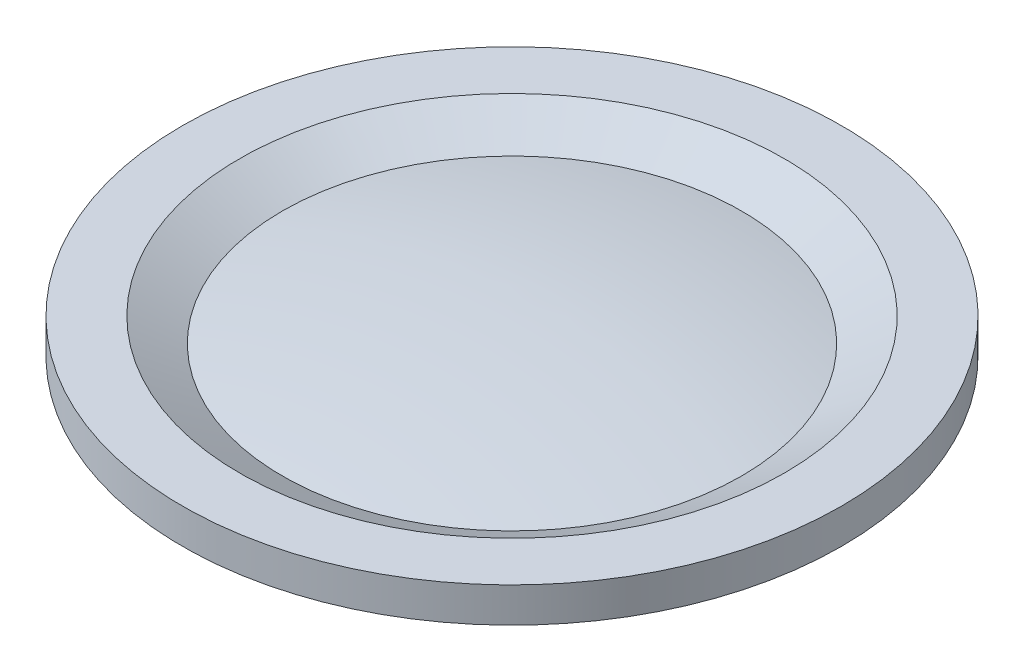
ISO-10303-21;
HEADER;
FILE_DESCRIPTION(('STEP AP214'),'2;1');
FILE_NAME('part.step','',(''),(''),'','','');
FILE_SCHEMA(('AUTOMOTIVE_DESIGN { 1 0 10303 214 1 1 1 1 }'));
ENDSEC;
DATA;
#1=APPLICATION_CONTEXT('core data for automotive mechanical design processes');
#2=APPLICATION_PROTOCOL_DEFINITION('international standard','automotive_design',2000,#1);
#3=PRODUCT_CONTEXT('',#1,'mechanical');
#4=PRODUCT('Part','Part','',(#3));
#5=PRODUCT_RELATED_PRODUCT_CATEGORY('part','',(#4));
#6=PRODUCT_DEFINITION_FORMATION('','',#4);
#7=PRODUCT_DEFINITION_CONTEXT('part definition',#1,'design');
#8=PRODUCT_DEFINITION('design','',#6,#7);
#9=PRODUCT_DEFINITION_SHAPE('','',#8);
#10=(LENGTH_UNIT() NAMED_UNIT(*) SI_UNIT(.MILLI.,.METRE.));
#11=(NAMED_UNIT(*) PLANE_ANGLE_UNIT() SI_UNIT($,.RADIAN.));
#12=(NAMED_UNIT(*) SI_UNIT($,.STERADIAN.) SOLID_ANGLE_UNIT());
#13=UNCERTAINTY_MEASURE_WITH_UNIT(LENGTH_MEASURE(1.E-05),#10,'distance_accuracy_value','');
#14=(GEOMETRIC_REPRESENTATION_CONTEXT(3) GLOBAL_UNCERTAINTY_ASSIGNED_CONTEXT((#13)) GLOBAL_UNIT_ASSIGNED_CONTEXT((#10,
#11,#12)) REPRESENTATION_CONTEXT('',''));
#15=CARTESIAN_POINT('',(0.,0.,0.));
#16=DIRECTION('',(0.,0.,1.));
#17=DIRECTION('',(1.,0.,0.));
#18=AXIS2_PLACEMENT_3D('',#15,#16,#17);
#19=CARTESIAN_POINT('',(0.,0.159999999999966,0.));
#20=DIRECTION('',(0.,1.,0.));
#21=DIRECTION('',(0.,0.,1.));
#22=AXIS2_PLACEMENT_3D('',#19,#20,#21);
#23=CYLINDRICAL_SURFACE('',#22,8.70000000000001);
#24=CARTESIAN_POINT('',(0.,1.59999999999997,0.));
#25=DIRECTION('',(0.,1.,0.));
#26=DIRECTION('',(0.,0.,-1.));
#27=AXIS2_PLACEMENT_3D('',#24,#25,#26);
#28=CIRCLE('',#27,8.70000000000001);
#29=CARTESIAN_POINT('',(7.275,1.59999999999997,-4.77120267857069));
#30=VERTEX_POINT('',#29);
#31=CARTESIAN_POINT('',(-7.275,1.59999999999997,-4.77120267857069));
#32=VERTEX_POINT('',#31);
#33=EDGE_CURVE('E104',#30,#32,#28,.T.);
#34=ORIENTED_EDGE('',*,*,#33,.T.);
#35=DIRECTION('',(0.,1.,0.));
#36=VECTOR('',#35,1.);
#37=CARTESIAN_POINT('',(-7.275,0.159999999999966,-4.77120267857069));
#38=LINE('',#37,#36);
#39=CARTESIAN_POINT('',(-7.275,0.159999999999966,-4.77120267857069));
#40=VERTEX_POINT('',#39);
#41=EDGE_CURVE('E12',#40,#32,#38,.T.);
#42=ORIENTED_EDGE('',*,*,#41,.F.);
#43=CARTESIAN_POINT('',(0.,0.159999999999966,0.));
#44=DIRECTION('',(0.,1.,0.));
#45=DIRECTION('',(0.,0.,-1.));
#46=AXIS2_PLACEMENT_3D('',#43,#44,#45);
#47=CIRCLE('',#46,8.70000000000001);
#48=CARTESIAN_POINT('',(7.275,0.159999999999966,-4.77120267857069));
#49=VERTEX_POINT('',#48);
#50=EDGE_CURVE('E92',#49,#40,#47,.T.);
#51=ORIENTED_EDGE('',*,*,#50,.F.);
#52=DIRECTION('',(0.,1.,0.));
#53=VECTOR('',#52,1.);
#54=CARTESIAN_POINT('',(7.275,0.159999999999966,-4.77120267857069));
#55=LINE('',#54,#53);
#56=EDGE_CURVE('E100',#49,#30,#55,.T.);
#57=ORIENTED_EDGE('',*,*,#56,.T.);
#58=EDGE_LOOP('',(#34,#42,#51,#57));
#59=FACE_BOUND('',#58,.T.);
#60=ADVANCED_FACE('F41',(#59),#23,.F.);
#61=CARTESIAN_POINT('',(-7.275,0.159999999999966,-4.77120267857069));
#62=DIRECTION('',(1.,0.,0.));
#63=DIRECTION('',(0.,0.,-1.));
#64=AXIS2_PLACEMENT_3D('',#61,#62,#63);
#65=PLANE('',#64);
#66=DIRECTION('',(0.,0.,-1.));
#67=VECTOR('',#66,1.);
#68=CARTESIAN_POINT('',(-7.275,1.59999999999997,-4.77120267857069));
#69=LINE('',#68,#67);
#70=CARTESIAN_POINT('',(-7.275,1.59999999999997,-12.4271627896314));
#71=VERTEX_POINT('',#70);
#72=EDGE_CURVE('E96',#32,#71,#69,.T.);
#73=ORIENTED_EDGE('',*,*,#72,.T.);
#74=DIRECTION('',(0.,1.,0.));
#75=VECTOR('',#74,1.);
#76=CARTESIAN_POINT('',(-7.275,0.159999999999966,-12.4271627896314));
#77=LINE('',#76,#75);
#78=CARTESIAN_POINT('',(-7.275,0.159999999999966,-12.4271627896314));
#79=VERTEX_POINT('',#78);
#80=EDGE_CURVE('E49',#79,#71,#77,.T.);
#81=ORIENTED_EDGE('',*,*,#80,.F.);
#82=DIRECTION('',(0.,0.,-1.));
#83=VECTOR('',#82,1.);
#84=CARTESIAN_POINT('',(-7.275,0.159999999999966,-4.77120267857069));
#85=LINE('',#84,#83);
#86=EDGE_CURVE('E87',#40,#79,#85,.T.);
#87=ORIENTED_EDGE('',*,*,#86,.F.);
#88=ORIENTED_EDGE('',*,*,#41,.T.);
#89=EDGE_LOOP('',(#73,#81,#87,#88));
#90=FACE_BOUND('',#89,.T.);
#91=ADVANCED_FACE('F95',(#90),#65,.F.);
#92=CARTESIAN_POINT('',(0.,0.159999999999966,0.));
#93=DIRECTION('',(0.,1.,0.));
#94=DIRECTION('',(0.,0.,1.));
#95=AXIS2_PLACEMENT_3D('',#92,#93,#94);
#96=CYLINDRICAL_SURFACE('',#95,14.4);
#97=CARTESIAN_POINT('',(0.,1.59999999999997,0.));
#98=DIRECTION('',(0.,-1.,0.));
#99=DIRECTION('',(0.,0.,-1.));
#100=AXIS2_PLACEMENT_3D('',#97,#98,#99);
#101=CIRCLE('',#100,14.4);
#102=CARTESIAN_POINT('',(7.27500000000001,1.59999999999997,-12.4271627896314));
#103=VERTEX_POINT('',#102);
#104=EDGE_CURVE('E74',#71,#103,#101,.T.);
#105=ORIENTED_EDGE('',*,*,#104,.T.);
#106=DIRECTION('',(0.,1.,0.));
#107=VECTOR('',#106,1.);
#108=CARTESIAN_POINT('',(7.27500000000001,0.159999999999966,-12.4271627896314));
#109=LINE('',#108,#107);
#110=CARTESIAN_POINT('',(7.27500000000001,0.159999999999966,-12.4271627896314));
#111=VERTEX_POINT('',#110);
#112=EDGE_CURVE('E97',#111,#103,#109,.T.);
#113=ORIENTED_EDGE('',*,*,#112,.F.);
#114=CARTESIAN_POINT('',(0.,0.159999999999966,0.));
#115=DIRECTION('',(0.,-1.,0.));
#116=DIRECTION('',(0.,0.,-1.));
#117=AXIS2_PLACEMENT_3D('',#114,#115,#116);
#118=CIRCLE('',#117,14.4);
#119=EDGE_CURVE('E90',#79,#111,#118,.T.);
#120=ORIENTED_EDGE('',*,*,#119,.F.);
#121=ORIENTED_EDGE('',*,*,#80,.T.);
#122=EDGE_LOOP('',(#105,#113,#120,#121));
#123=FACE_BOUND('',#122,.T.);
#124=ADVANCED_FACE('F98',(#123),#96,.T.);
#125=CARTESIAN_POINT('',(7.275,0.159999999999966,-4.77120267857069));
#126=DIRECTION('',(-1.,0.,0.));
#127=DIRECTION('',(0.,0.,1.));
#128=AXIS2_PLACEMENT_3D('',#125,#126,#127);
#129=PLANE('',#128);
#130=DIRECTION('',(0.,0.,1.));
#131=VECTOR('',#130,1.);
#132=CARTESIAN_POINT('',(7.275,1.59999999999997,-4.77120267857069));
#133=LINE('',#132,#131);
#134=EDGE_CURVE('E80',#103,#30,#133,.T.);
#135=ORIENTED_EDGE('',*,*,#134,.T.);
#136=ORIENTED_EDGE('',*,*,#56,.F.);
#137=DIRECTION('',(0.,0.,1.));
#138=VECTOR('',#137,1.);
#139=CARTESIAN_POINT('',(7.275,0.159999999999966,-4.77120267857069));
#140=LINE('',#139,#138);
#141=EDGE_CURVE('E57',#111,#49,#140,.T.);
#142=ORIENTED_EDGE('',*,*,#141,.F.);
#143=ORIENTED_EDGE('',*,*,#112,.T.);
#144=EDGE_LOOP('',(#135,#136,#142,#143));
#145=FACE_BOUND('',#144,.T.);
#146=ADVANCED_FACE('F111',(#145),#129,.F.);
#147=CARTESIAN_POINT('',(0.,0.159999999999966,0.));
#148=DIRECTION('',(0.,-1.,0.));
#149=DIRECTION('',(0.,0.,-1.));
#150=AXIS2_PLACEMENT_3D('',#147,#148,#149);
#151=PLANE('',#150);
#152=ORIENTED_EDGE('',*,*,#50,.T.);
#153=ORIENTED_EDGE('',*,*,#86,.T.);
#154=ORIENTED_EDGE('',*,*,#119,.T.);
#155=ORIENTED_EDGE('',*,*,#141,.T.);
#156=EDGE_LOOP('',(#152,#153,#154,#155));
#157=FACE_BOUND('',#156,.T.);
#158=ADVANCED_FACE('F88',(#157),#151,.T.);
#159=CARTESIAN_POINT('',(0.,1.59999999999997,0.));
#160=DIRECTION('',(0.,-1.,0.));
#161=DIRECTION('',(0.,0.,-1.));
#162=AXIS2_PLACEMENT_3D('',#159,#160,#161);
#163=PLANE('',#162);
#164=ORIENTED_EDGE('',*,*,#33,.F.);
#165=ORIENTED_EDGE('',*,*,#134,.F.);
#166=ORIENTED_EDGE('',*,*,#104,.F.);
#167=ORIENTED_EDGE('',*,*,#72,.F.);
#168=EDGE_LOOP('',(#164,#165,#166,#167));
#169=FACE_BOUND('',#168,.T.);
#170=ADVANCED_FACE('F114',(#169),#163,.F.);
#171=CLOSED_SHELL('',(#60,#91,#124,#146,#158,#170));
#172=MANIFOLD_SOLID_BREP('B2',#171);
#173=CARTESIAN_POINT('',(0.,0.,0.));
#174=DIRECTION('',(0.,1.,0.));
#175=DIRECTION('',(-1.,0.,0.));
#176=AXIS2_PLACEMENT_3D('',#173,#174,#175);
#177=PLANE('',#176);
#178=CARTESIAN_POINT('',(0.,0.,0.));
#179=DIRECTION('',(0.,-1.,0.));
#180=DIRECTION('',(1.,0.,0.));
#181=AXIS2_PLACEMENT_3D('',#178,#179,#180);
#182=CIRCLE('',#181,8.1);
#183=CARTESIAN_POINT('',(8.1,0.,0.));
#184=VERTEX_POINT('',#183);
#185=EDGE_CURVE('E40',#184,#184,#182,.T.);
#186=ORIENTED_EDGE('',*,*,#185,.T.);
#187=EDGE_LOOP('',(#186));
#188=FACE_BOUND('',#187,.T.);
#189=ADVANCED_FACE('F165',(#188),#177,.F.);
#190=CARTESIAN_POINT('',(0.,0.,0.));
#191=DIRECTION('',(0.,-1.,0.));
#192=DIRECTION('',(1.,0.,0.));
#193=AXIS2_PLACEMENT_3D('',#190,#191,#192);
#194=CYLINDRICAL_SURFACE('',#193,8.1);
#195=ORIENTED_EDGE('',*,*,#185,.F.);
#196=EDGE_LOOP('',(#195));
#197=FACE_BOUND('',#196,.T.);
#198=CARTESIAN_POINT('',(0.,1.59999999999998,0.));
#199=DIRECTION('',(0.,-1.,0.));
#200=DIRECTION('',(1.,0.,0.));
#201=AXIS2_PLACEMENT_3D('',#198,#199,#200);
#202=CIRCLE('',#201,8.1);
#203=CARTESIAN_POINT('',(8.10000000000001,1.59999999999995,0.));
#204=VERTEX_POINT('',#203);
#205=EDGE_CURVE('E171',#204,#204,#202,.T.);
#206=ORIENTED_EDGE('',*,*,#205,.T.);
#207=EDGE_LOOP('',(#206));
#208=FACE_BOUND('',#207,.T.);
#209=ADVANCED_FACE('F209',(#197,#208),#194,.T.);
#210=CARTESIAN_POINT('',(-8.1,1.59999999999999,0.));
#211=DIRECTION('',(0.,1.,0.));
#212=DIRECTION('',(-1.,0.,0.));
#213=AXIS2_PLACEMENT_3D('',#210,#211,#212);
#214=PLANE('',#213);
#215=ORIENTED_EDGE('',*,*,#205,.F.);
#216=EDGE_LOOP('',(#215));
#217=FACE_BOUND('',#216,.T.);
#218=CARTESIAN_POINT('',(0.,1.59999999999996,0.));
#219=DIRECTION('',(0.,-1.,0.));
#220=DIRECTION('',(1.,0.,0.));
#221=AXIS2_PLACEMENT_3D('',#218,#219,#220);
#222=CIRCLE('',#221,14.4);
#223=CARTESIAN_POINT('',(14.4,1.59999999999991,0.));
#224=VERTEX_POINT('',#223);
#225=EDGE_CURVE('E175',#224,#224,#222,.T.);
#226=ORIENTED_EDGE('',*,*,#225,.T.);
#227=EDGE_LOOP('',(#226));
#228=FACE_BOUND('',#227,.T.);
#229=ADVANCED_FACE('F213',(#217,#228),#214,.F.);
#230=CARTESIAN_POINT('',(0.,2.94999999999995,0.));
#231=DIRECTION('',(0.,1.,0.));
#232=DIRECTION('',(-1.,0.,0.));
#233=AXIS2_PLACEMENT_3D('',#230,#231,#232);
#234=CONICAL_SURFACE('',#233,15.75,0.785398163397449);
#235=ORIENTED_EDGE('',*,*,#225,.F.);
#236=EDGE_LOOP('',(#235));
#237=FACE_BOUND('',#236,.T.);
#238=CARTESIAN_POINT('',(0.,2.94999999999995,0.));
#239=DIRECTION('',(0.,-1.,0.));
#240=DIRECTION('',(1.,0.,0.));
#241=AXIS2_PLACEMENT_3D('',#238,#239,#240);
#242=CIRCLE('',#241,15.75);
#243=CARTESIAN_POINT('',(15.75,2.94999999999991,0.));
#244=VERTEX_POINT('',#243);
#245=EDGE_CURVE('E179',#244,#244,#242,.T.);
#246=ORIENTED_EDGE('',*,*,#245,.T.);
#247=EDGE_LOOP('',(#246));
#248=FACE_BOUND('',#247,.T.);
#249=ADVANCED_FACE('F218',(#237,#248),#234,.T.);
#250=CARTESIAN_POINT('',(-15.75,2.94999999999999,0.));
#251=DIRECTION('',(0.,1.,0.));
#252=DIRECTION('',(-1.,0.,0.));
#253=AXIS2_PLACEMENT_3D('',#250,#251,#252);
#254=PLANE('',#253);
#255=ORIENTED_EDGE('',*,*,#245,.F.);
#256=EDGE_LOOP('',(#255));
#257=FACE_BOUND('',#256,.T.);
#258=CARTESIAN_POINT('',(0.,2.94999999999994,0.));
#259=DIRECTION('',(0.,-1.,0.));
#260=DIRECTION('',(1.,0.,0.));
#261=AXIS2_PLACEMENT_3D('',#258,#259,#260);
#262=CIRCLE('',#261,17.95);
#263=CARTESIAN_POINT('',(17.95,2.94999999999989,0.));
#264=VERTEX_POINT('',#263);
#265=EDGE_CURVE('E184',#264,#264,#262,.T.);
#266=ORIENTED_EDGE('',*,*,#265,.T.);
#267=EDGE_LOOP('',(#266));
#268=FACE_BOUND('',#267,.T.);
#269=ADVANCED_FACE('F224',(#257,#268),#254,.F.);
#270=CARTESIAN_POINT('',(0.,0.,0.));
#271=DIRECTION('',(0.,-1.,0.));
#272=DIRECTION('',(1.,0.,0.));
#273=AXIS2_PLACEMENT_3D('',#270,#271,#272);
#274=CYLINDRICAL_SURFACE('',#273,17.95);
#275=ORIENTED_EDGE('',*,*,#265,.F.);
#276=EDGE_LOOP('',(#275));
#277=FACE_BOUND('',#276,.T.);
#278=CARTESIAN_POINT('',(0.,4.84999999999994,0.));
#279=DIRECTION('',(0.,-1.,0.));
#280=DIRECTION('',(1.,0.,0.));
#281=AXIS2_PLACEMENT_3D('',#278,#279,#280);
#282=CIRCLE('',#281,17.95);
#283=CARTESIAN_POINT('',(17.95,4.84999999999989,0.));
#284=VERTEX_POINT('',#283);
#285=EDGE_CURVE('E187',#284,#284,#282,.T.);
#286=ORIENTED_EDGE('',*,*,#285,.T.);
#287=EDGE_LOOP('',(#286));
#288=FACE_BOUND('',#287,.T.);
#289=ADVANCED_FACE('F228',(#277,#288),#274,.T.);
#290=CARTESIAN_POINT('',(-17.95,4.85,0.));
#291=DIRECTION('',(0.,-1.,0.));
#292=DIRECTION('',(1.,0.,0.));
#293=AXIS2_PLACEMENT_3D('',#290,#291,#292);
#294=PLANE('',#293);
#295=ORIENTED_EDGE('',*,*,#285,.F.);
#296=EDGE_LOOP('',(#295));
#297=FACE_BOUND('',#296,.T.);
#298=CARTESIAN_POINT('',(0.,4.84999999999995,0.));
#299=DIRECTION('',(0.,-1.,0.));
#300=DIRECTION('',(1.,0.,0.));
#301=AXIS2_PLACEMENT_3D('',#298,#299,#300);
#302=CIRCLE('',#301,14.8351333006812);
#303=CARTESIAN_POINT('',(14.8351333006812,4.84999999999991,0.));
#304=VERTEX_POINT('',#303);
#305=EDGE_CURVE('E190',#304,#304,#302,.T.);
#306=ORIENTED_EDGE('',*,*,#305,.T.);
#307=EDGE_LOOP('',(#306));
#308=FACE_BOUND('',#307,.T.);
#309=ADVANCED_FACE('F205',(#297,#308),#294,.F.);
#310=CARTESIAN_POINT('',(0.,3.54687011301458,0.));
#311=DIRECTION('',(0.,1.,0.));
#312=DIRECTION('',(-1.,0.,0.));
#313=AXIS2_PLACEMENT_3D('',#310,#311,#312);
#314=CONICAL_SURFACE('',#313,12.5054910735935,1.06078841361515);
#315=ORIENTED_EDGE('',*,*,#305,.F.);
#316=EDGE_LOOP('',(#315));
#317=FACE_BOUND('',#316,.T.);
#318=CARTESIAN_POINT('',(0.,3.54687011301458,0.));
#319=DIRECTION('',(0.,-1.,0.));
#320=DIRECTION('',(1.,0.,0.));
#321=AXIS2_PLACEMENT_3D('',#318,#319,#320);
#322=CIRCLE('',#321,12.5054910735935);
#323=CARTESIAN_POINT('',(12.5054910735935,3.54687011301455,0.));
#324=VERTEX_POINT('',#323);
#325=EDGE_CURVE('E193',#324,#324,#322,.T.);
#326=ORIENTED_EDGE('',*,*,#325,.T.);
#327=EDGE_LOOP('',(#326));
#328=FACE_BOUND('',#327,.T.);
#329=ADVANCED_FACE('F197',(#317,#328),#314,.F.);
#330=CARTESIAN_POINT('',(0.,-55.8060620214892,0.));
#331=DIRECTION('',(0.,-1.,0.));
#332=DIRECTION('',(-1.,0.,0.));
#333=AXIS2_PLACEMENT_3D('',#330,#331,#332);
#334=SPHERICAL_SURFACE('',#333,60.6560620214892);
#335=ORIENTED_EDGE('',*,*,#325,.F.);
#336=EDGE_LOOP('',(#335));
#337=FACE_BOUND('',#336,.T.);
#338=ADVANCED_FACE('F199',(#337),#334,.T.);
#339=CLOSED_SHELL('',(#189,#209,#229,#249,#269,#289,#309,#329,#338));
#340=MANIFOLD_SOLID_BREP('B6',#339);
#341=ADVANCED_BREP_SHAPE_REPRESENTATION('',(#18,#172,#340),#14);
#342=SHAPE_DEFINITION_REPRESENTATION(#9,#341);
ENDSEC;
END-ISO-10303-21;
